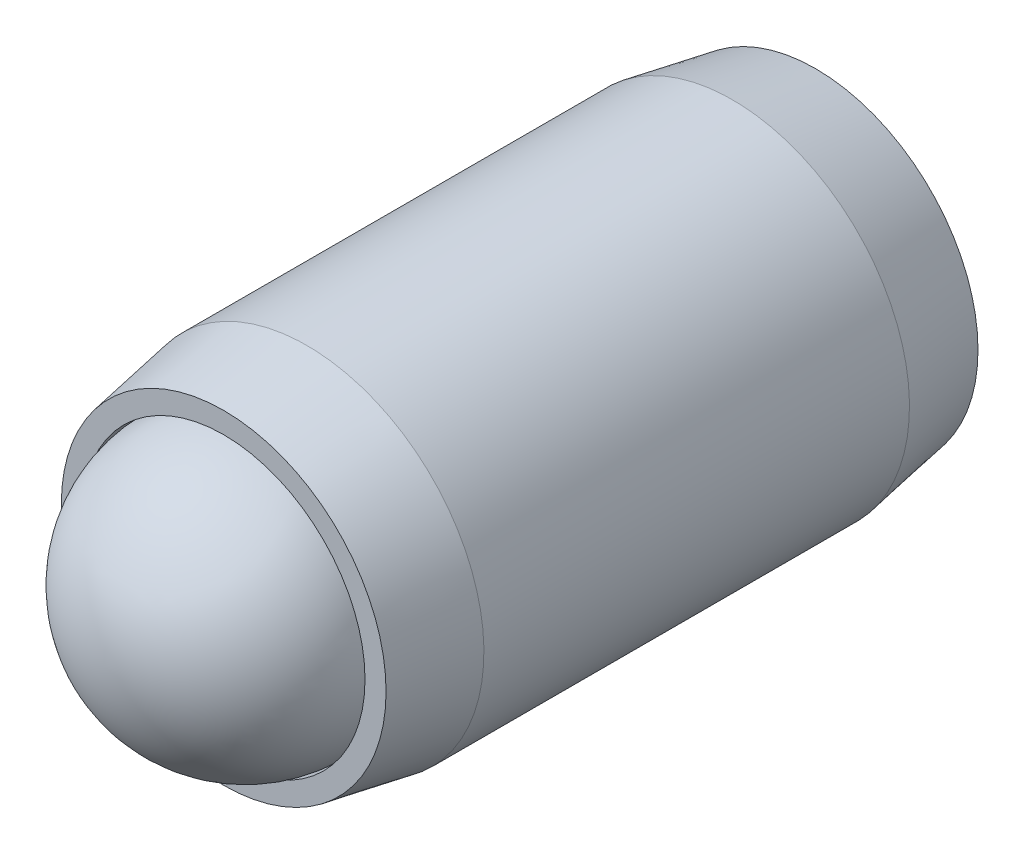
ISO-10303-21;
HEADER;
FILE_DESCRIPTION(('STEP AP214'),'2;1');
FILE_NAME('part.step','',(''),(''),'','','');
FILE_SCHEMA(('AUTOMOTIVE_DESIGN { 1 0 10303 214 1 1 1 1 }'));
ENDSEC;
DATA;
#1=APPLICATION_CONTEXT('core data for automotive mechanical design processes');
#2=APPLICATION_PROTOCOL_DEFINITION('international standard','automotive_design',2000,#1);
#3=PRODUCT_CONTEXT('',#1,'mechanical');
#4=PRODUCT('Part','Part','',(#3));
#5=PRODUCT_RELATED_PRODUCT_CATEGORY('part','',(#4));
#6=PRODUCT_DEFINITION_FORMATION('','',#4);
#7=PRODUCT_DEFINITION_CONTEXT('part definition',#1,'design');
#8=PRODUCT_DEFINITION('design','',#6,#7);
#9=PRODUCT_DEFINITION_SHAPE('','',#8);
#10=(LENGTH_UNIT() NAMED_UNIT(*) SI_UNIT(.MILLI.,.METRE.));
#11=(NAMED_UNIT(*) PLANE_ANGLE_UNIT() SI_UNIT($,.RADIAN.));
#12=(NAMED_UNIT(*) SI_UNIT($,.STERADIAN.) SOLID_ANGLE_UNIT());
#13=UNCERTAINTY_MEASURE_WITH_UNIT(LENGTH_MEASURE(1.E-05),#10,'distance_accuracy_value','');
#14=(GEOMETRIC_REPRESENTATION_CONTEXT(3) GLOBAL_UNCERTAINTY_ASSIGNED_CONTEXT((#13)) GLOBAL_UNIT_ASSIGNED_CONTEXT((#10,
#11,#12)) REPRESENTATION_CONTEXT('',''));
#15=CARTESIAN_POINT('',(0.,0.,0.));
#16=DIRECTION('',(0.,0.,1.));
#17=DIRECTION('',(1.,0.,0.));
#18=AXIS2_PLACEMENT_3D('',#15,#16,#17);
#19=CARTESIAN_POINT('',(0.,0.,4.63541968187893));
#20=DIRECTION('',(-0.605860662373687,-0.795570774845405,0.));
#21=DIRECTION('',(-0.795570774845405,0.605860662373687,0.));
#22=AXIS2_PLACEMENT_3D('',#19,#20,#21);
#23=SPHERICAL_SURFACE('',#22,2.38125);
#24=CARTESIAN_POINT('',(0.,0.,4.63541968187893));
#25=DIRECTION('',(0.,0.,-1.));
#26=DIRECTION('',(-0.795570774845405,0.605860662373687,0.));
#27=AXIS2_PLACEMENT_3D('',#24,#25,#26);
#28=SPHERICAL_SURFACE('',#27,2.38125);
#29=CARTESIAN_POINT('',(0.,0.,4.63541968187893));
#30=DIRECTION('',(0.,0.,-1.));
#31=DIRECTION('',(-0.795570774845405,0.605860662373687,0.));
#32=AXIS2_PLACEMENT_3D('',#29,#30,#31);
#33=CIRCLE('',#32,2.38125);
#34=CARTESIAN_POINT('',(-1.89445290760062,1.44270570227734,4.63541968187893));
#35=VERTEX_POINT('',#34);
#36=EDGE_CURVE('P0_E10',#35,#35,#33,.T.);
#37=ORIENTED_EDGE('',*,*,#36,.T.);
#38=EDGE_LOOP('',(#37));
#39=FACE_BOUND('',#38,.T.);
#40=ADVANCED_FACE('P0_F14',(#39),#28,.T.);
#41=CARTESIAN_POINT('',(0.,0.,4.63541968187893));
#42=DIRECTION('',(0.,0.,-1.));
#43=DIRECTION('',(-0.795570774845405,0.605860662373687,0.));
#44=AXIS2_PLACEMENT_3D('',#41,#42,#43);
#45=SPHERICAL_SURFACE('',#44,2.38125);
#46=ORIENTED_EDGE('',*,*,#36,.F.);
#47=EDGE_LOOP('',(#46));
#48=FACE_BOUND('',#47,.T.);
#49=ADVANCED_FACE('P0_F16',(#48),#45,.T.);
#50=CLOSED_SHELL('',(#40,#49));
#51=MANIFOLD_SOLID_BREP('P0_B1',#50);
#52=CARTESIAN_POINT('',(0.,0.,4.999999938));
#53=DIRECTION('',(0.,0.,-1.));
#54=DIRECTION('',(-1.,0.,0.));
#55=AXIS2_PLACEMENT_3D('',#52,#53,#54);
#56=CYLINDRICAL_SURFACE('',#55,2.991);
#57=CARTESIAN_POINT('',(0.,0.,3.59465630309867));
#58=DIRECTION('',(0.,0.,1.));
#59=DIRECTION('',(0.,-1.,0.));
#60=AXIS2_PLACEMENT_3D('',#57,#58,#59);
#61=CIRCLE('',#60,2.991);
#62=CARTESIAN_POINT('',(0.,-2.991,3.59465630309867));
#63=VERTEX_POINT('',#62);
#64=EDGE_CURVE('P1_E183',#63,#63,#61,.T.);
#65=ORIENTED_EDGE('',*,*,#64,.F.);
#66=EDGE_LOOP('',(#65));
#67=FACE_BOUND('',#66,.T.);
#68=CARTESIAN_POINT('',(0.,0.,-3.59465630309867));
#69=DIRECTION('',(0.,0.,1.));
#70=DIRECTION('',(0.,-1.,0.));
#71=AXIS2_PLACEMENT_3D('',#68,#69,#70);
#72=CIRCLE('',#71,2.991);
#73=CARTESIAN_POINT('',(0.,-2.991,-3.59465630309867));
#74=VERTEX_POINT('',#73);
#75=EDGE_CURVE('P1_E186',#74,#74,#72,.T.);
#76=ORIENTED_EDGE('',*,*,#75,.T.);
#77=EDGE_LOOP('',(#76));
#78=FACE_BOUND('',#77,.T.);
#79=ADVANCED_FACE('P1_F15',(#67,#78),#56,.T.);
#80=CARTESIAN_POINT('',(0.,0.,4.999999938));
#81=DIRECTION('',(0.,0.,-1.));
#82=DIRECTION('',(0.,1.,0.));
#83=AXIS2_PLACEMENT_3D('',#80,#81,#82);
#84=CONICAL_SURFACE('',#83,2.7432,0.174532925199426);
#85=ORIENTED_EDGE('',*,*,#64,.T.);
#86=EDGE_LOOP('',(#85));
#87=FACE_BOUND('',#86,.T.);
#88=CARTESIAN_POINT('',(0.,0.,4.999999938));
#89=DIRECTION('',(0.,0.,1.));
#90=DIRECTION('',(0.,-1.,0.));
#91=AXIS2_PLACEMENT_3D('',#88,#89,#90);
#92=CIRCLE('',#91,2.7432);
#93=CARTESIAN_POINT('',(0.,-2.7432,4.999999938));
#94=VERTEX_POINT('',#93);
#95=EDGE_CURVE('P1_E199',#94,#94,#92,.T.);
#96=ORIENTED_EDGE('',*,*,#95,.F.);
#97=EDGE_LOOP('',(#96));
#98=FACE_BOUND('',#97,.T.);
#99=ADVANCED_FACE('P1_F161',(#87,#98),#84,.T.);
#100=CARTESIAN_POINT('',(0.,0.,4.999999938));
#101=DIRECTION('',(0.,0.,1.));
#102=DIRECTION('',(1.,0.,0.));
#103=AXIS2_PLACEMENT_3D('',#100,#101,#102);
#104=PLANE('',#103);
#105=CARTESIAN_POINT('',(0.,0.,4.999999938));
#106=DIRECTION('',(0.,0.,1.));
#107=DIRECTION('',(1.,0.,0.));
#108=AXIS2_PLACEMENT_3D('',#105,#106,#107);
#109=CIRCLE('',#108,2.3876);
#110=CARTESIAN_POINT('',(2.3876,0.,4.999999938));
#111=VERTEX_POINT('',#110);
#112=EDGE_CURVE('P1_E194',#111,#111,#109,.T.);
#113=ORIENTED_EDGE('',*,*,#112,.F.);
#114=EDGE_LOOP('',(#113));
#115=FACE_BOUND('',#114,.T.);
#116=ORIENTED_EDGE('',*,*,#95,.T.);
#117=EDGE_LOOP('',(#116));
#118=FACE_BOUND('',#117,.T.);
#119=ADVANCED_FACE('P1_F158',(#115,#118),#104,.T.);
#120=CARTESIAN_POINT('',(0.,0.,-3.59465630309867));
#121=DIRECTION('',(0.,0.,1.));
#122=DIRECTION('',(0.,-1.,0.));
#123=AXIS2_PLACEMENT_3D('',#120,#121,#122);
#124=CONICAL_SURFACE('',#123,2.991,0.174532925199426);
#125=CARTESIAN_POINT('',(0.,0.,-4.999999938));
#126=DIRECTION('',(0.,0.,1.));
#127=DIRECTION('',(0.,-1.,0.));
#128=AXIS2_PLACEMENT_3D('',#125,#126,#127);
#129=CIRCLE('',#128,2.7432);
#130=CARTESIAN_POINT('',(0.,-2.7432,-4.999999938));
#131=VERTEX_POINT('',#130);
#132=EDGE_CURVE('P1_E188',#131,#131,#129,.T.);
#133=ORIENTED_EDGE('',*,*,#132,.T.);
#134=EDGE_LOOP('',(#133));
#135=FACE_BOUND('',#134,.T.);
#136=ORIENTED_EDGE('',*,*,#75,.F.);
#137=EDGE_LOOP('',(#136));
#138=FACE_BOUND('',#137,.T.);
#139=ADVANCED_FACE('P1_F160',(#135,#138),#124,.T.);
#140=CARTESIAN_POINT('',(0.,0.,-4.999999938));
#141=DIRECTION('',(0.,0.,1.));
#142=DIRECTION('',(1.,0.,0.));
#143=AXIS2_PLACEMENT_3D('',#140,#141,#142);
#144=PLANE('',#143);
#145=CARTESIAN_POINT('',(0.,0.,-4.999999938));
#146=DIRECTION('',(0.,0.,1.));
#147=DIRECTION('',(1.,0.,0.));
#148=AXIS2_PLACEMENT_3D('',#145,#146,#147);
#149=CIRCLE('',#148,1.14567944042316);
#150=CARTESIAN_POINT('',(0.572839720211583,-0.992187499999999,-4.999999938));
#151=VERTEX_POINT('',#150);
#152=CARTESIAN_POINT('',(1.14567944042316,0.,-4.999999938));
#153=VERTEX_POINT('',#152);
#154=EDGE_CURVE('P1_E18',#151,#153,#149,.T.);
#155=ORIENTED_EDGE('',*,*,#154,.T.);
#156=CARTESIAN_POINT('',(0.572839720211582,0.9921875,-4.999999938));
#157=VERTEX_POINT('',#156);
#158=EDGE_CURVE('P1_E10',#153,#157,#149,.T.);
#159=ORIENTED_EDGE('',*,*,#158,.T.);
#160=CARTESIAN_POINT('',(-0.572839720211582,0.9921875,-4.999999938));
#161=VERTEX_POINT('',#160);
#162=EDGE_CURVE('P1_E23',#157,#161,#149,.T.);
#163=ORIENTED_EDGE('',*,*,#162,.T.);
#164=CARTESIAN_POINT('',(0.,0.,-4.999999938));
#165=DIRECTION('',(0.,0.,-1.));
#166=DIRECTION('',(-1.,0.,0.));
#167=AXIS2_PLACEMENT_3D('',#164,#165,#166);
#168=CIRCLE('',#167,1.14567944042316);
#169=CARTESIAN_POINT('',(-1.14567944042316,0.,-4.999999938));
#170=VERTEX_POINT('',#169);
#171=EDGE_CURVE('P1_E76',#170,#161,#168,.T.);
#172=ORIENTED_EDGE('',*,*,#171,.F.);
#173=CARTESIAN_POINT('',(-0.572839720211581,-0.9921875,-4.999999938));
#174=VERTEX_POINT('',#173);
#175=EDGE_CURVE('P1_E84',#170,#174,#149,.T.);
#176=ORIENTED_EDGE('',*,*,#175,.T.);
#177=EDGE_CURVE('P1_E89',#174,#151,#149,.T.);
#178=ORIENTED_EDGE('',*,*,#177,.T.);
#179=EDGE_LOOP('',(#155,#159,#163,#172,#176,#178));
#180=FACE_BOUND('',#179,.T.);
#181=ORIENTED_EDGE('',*,*,#132,.F.);
#182=EDGE_LOOP('',(#181));
#183=FACE_BOUND('',#182,.T.);
#184=ADVANCED_FACE('P1_F90',(#180,#183),#144,.F.);
#185=CARTESIAN_POINT('',(0.,0.,3.655423636478));
#186=DIRECTION('',(0.,0.,1.));
#187=DIRECTION('',(1.,0.,0.));
#188=AXIS2_PLACEMENT_3D('',#185,#186,#187);
#189=CONICAL_SURFACE('',#188,2.3876,0.78539816339745);
#190=CARTESIAN_POINT('',(0.,0.,1.267823636478));
#191=VERTEX_POINT('',#190);
#192=VERTEX_LOOP('',#191);
#193=FACE_BOUND('',#192,.T.);
#194=CARTESIAN_POINT('',(0.,0.,3.655423636478));
#195=DIRECTION('',(0.,0.,1.));
#196=DIRECTION('',(1.,0.,0.));
#197=AXIS2_PLACEMENT_3D('',#194,#195,#196);
#198=CIRCLE('',#197,2.3876);
#199=CARTESIAN_POINT('',(2.3876,0.,3.655423636478));
#200=VERTEX_POINT('',#199);
#201=EDGE_CURVE('P1_E189',#200,#200,#198,.T.);
#202=ORIENTED_EDGE('',*,*,#201,.T.);
#203=EDGE_LOOP('',(#202));
#204=FACE_BOUND('',#203,.T.);
#205=ADVANCED_FACE('P1_F164',(#193,#204),#189,.F.);
#206=CARTESIAN_POINT('',(0.,0.,4.999999938));
#207=DIRECTION('',(0.,0.,1.));
#208=DIRECTION('',(1.,0.,0.));
#209=AXIS2_PLACEMENT_3D('',#206,#207,#208);
#210=CYLINDRICAL_SURFACE('',#209,2.3876);
#211=ORIENTED_EDGE('',*,*,#201,.F.);
#212=EDGE_LOOP('',(#211));
#213=FACE_BOUND('',#212,.T.);
#214=ORIENTED_EDGE('',*,*,#112,.T.);
#215=EDGE_LOOP('',(#214));
#216=FACE_BOUND('',#215,.T.);
#217=ADVANCED_FACE('P1_F131',(#213,#216),#210,.F.);
#218=CARTESIAN_POINT('',(0.,0.,-4.999999938));
#219=DIRECTION('',(0.,0.,-1.));
#220=DIRECTION('',(-1.,0.,0.));
#221=AXIS2_PLACEMENT_3D('',#218,#219,#220);
#222=CONICAL_SURFACE('',#221,1.14567944042316,0.78539816339745);
#223=ORIENTED_EDGE('',*,*,#154,.F.);
#224=CARTESIAN_POINT('',(1.145794910477,0.000199999999999862,-5.00011542550897));
#225=CARTESIAN_POINT('',(1.12609913995856,-0.0339140752321561,-4.98043274940465));
#226=CARTESIAN_POINT('',(1.10607402631377,-0.0685985894922797,-4.96190562251841));
#227=CARTESIAN_POINT('',(1.06524035596264,-0.139324581199959,-4.92798226765041));
#228=CARTESIAN_POINT('',(1.04442791197037,-0.175372791624242,-4.91260492523095));
#229=CARTESIAN_POINT('',(1.00246048249572,-0.248062511737395,-4.88626308073428));
#230=CARTESIAN_POINT('',(0.981316196707012,-0.284685489013201,-4.87523233451314));
#231=CARTESIAN_POINT('',(0.938562244623588,-0.358737506246056,-4.85823614367294));
#232=CARTESIAN_POINT('',(0.916953885244212,-0.396164282559342,-4.85225800557892));
#233=CARTESIAN_POINT('',(0.879714587318154,-0.46066463860547,-4.84686628291429));
#234=CARTESIAN_POINT('',(0.864132099442442,-0.487654299314529,-4.84606893438834));
#235=CARTESIAN_POINT('',(0.832997298779852,-0.541581355945663,-4.84740813136142));
#236=CARTESIAN_POINT('',(0.817444993408173,-0.568518739024239,-4.84954532413705));
#237=CARTESIAN_POINT('',(0.771010163908485,-0.648946222958496,-4.86021750930602));
#238=CARTESIAN_POINT('',(0.740358726795446,-0.702036069363282,-4.87301431872271));
#239=CARTESIAN_POINT('',(0.68656205513008,-0.795214637965796,-4.90389740565013));
#240=CARTESIAN_POINT('',(0.663164549602744,-0.835740306309515,-4.9203649469077));
#241=CARTESIAN_POINT('',(0.617285982385523,-0.915204315708207,-4.95746032155681));
#242=CARTESIAN_POINT('',(0.594802217831308,-0.954147338261523,-4.97807461864554));
#243=CARTESIAN_POINT('',(0.572724250157744,-0.992387499999999,-5.00011542550897));
#244=B_SPLINE_CURVE_WITH_KNOTS('',3,(#224,#225,#226,#227,#228,#229,#230,#231,#232,#233,#234,
#235,#236,#237,#238,#239,#240,#241,#242,#243),.UNSPECIFIED.,.F.,.F.,(4,2,2,2,2,2,2,2,2,4),(0.,
0.13219718521019,0.265165186853262,0.396020097605669,0.526545281028573,0.619935205043264,
0.713345731536163,0.900220051846368,1.04884529769095,1.1969930355767),.UNSPECIFIED.);
#245=EDGE_CURVE('P1_E108',#153,#151,#244,.T.);
#246=ORIENTED_EDGE('',*,*,#245,.F.);
#247=EDGE_LOOP('',(#223,#246));
#248=FACE_BOUND('',#247,.T.);
#249=ADVANCED_FACE('P1_F126',(#248),#222,.F.);
#250=ORIENTED_EDGE('',*,*,#177,.F.);
#251=CARTESIAN_POINT('',(-1.14247621095534,-0.9921875,-5.36749197753379));
#252=CARTESIAN_POINT('',(-1.11465764817297,-0.9921875,-5.34649157737037));
#253=CARTESIAN_POINT('',(-1.08668408109739,-0.9921875,-5.32569708582163));
#254=CARTESIAN_POINT('',(-1.03036405380652,-0.9921875,-5.28460497579312));
#255=CARTESIAN_POINT('',(-1.00201750238008,-0.9921875,-5.26430748245849));
#256=CARTESIAN_POINT('',(-0.915909012474785,-0.9921875,-5.20399844558086));
#257=CARTESIAN_POINT('',(-0.857501195957519,-0.9921875,-5.16489379024995));
#258=CARTESIAN_POINT('',(-0.735022281337406,-0.9921875,-5.08812669081868));
#259=CARTESIAN_POINT('',(-0.670818221979872,-0.9921875,-5.0506739690437));
#260=CARTESIAN_POINT('',(-0.539203244273795,-0.9921875,-4.98216495848978));
#261=CARTESIAN_POINT('',(-0.471804119013398,-0.9921875,-4.95108710627442));
#262=CARTESIAN_POINT('',(-0.370637445291611,-0.9921875,-4.91306623424996));
#263=CARTESIAN_POINT('',(-0.338367677294405,-0.9921875,-4.9021539703464));
#264=CARTESIAN_POINT('',(-0.273049086298104,-0.9921875,-4.88292016811298));
#265=CARTESIAN_POINT('',(-0.240000209797912,-0.9921875,-4.87459880826028));
#266=CARTESIAN_POINT('',(-0.173878395879219,-0.9921875,-4.86111871169319));
#267=CARTESIAN_POINT('',(-0.140816774783574,-0.9921875,-4.85590533197466));
#268=CARTESIAN_POINT('',(-0.0743291672741459,-0.9921875,-4.84873965046279));
#269=CARTESIAN_POINT('',(-0.0409031260707376,-0.9921875,-4.8467878460388));
#270=CARTESIAN_POINT('',(0.0247631140270456,-0.9921875,-4.84629342390368));
#271=CARTESIAN_POINT('',(0.057002444411226,-0.9921875,-4.84762996941573));
#272=CARTESIAN_POINT('',(0.121194220405734,-0.9921875,-4.85337098120236));
#273=CARTESIAN_POINT('',(0.153146730267991,-0.9921875,-4.85777474207893));
#274=CARTESIAN_POINT('',(0.217090524553671,-0.9921875,-4.86948444913751));
#275=CARTESIAN_POINT('',(0.249072542042749,-0.9921875,-4.87684024041065));
#276=CARTESIAN_POINT('',(0.312337779646055,-0.9921875,-4.89406302935171));
#277=CARTESIAN_POINT('',(0.34362105799319,-0.9921875,-4.90392981689742));
#278=CARTESIAN_POINT('',(0.442112982998624,-0.9921875,-4.93870604954092));
#279=CARTESIAN_POINT('',(0.507919771037747,-0.9921875,-4.96757610207796));
#280=CARTESIAN_POINT('',(0.636441890981752,-0.9921875,-5.03176514781482));
#281=CARTESIAN_POINT('',(0.699145053739845,-0.9921875,-5.06710731008238));
#282=CARTESIAN_POINT('',(0.818979829838884,-0.9921875,-5.14002130870446));
#283=CARTESIAN_POINT('',(0.876233471440129,-0.9921875,-5.17739507286827));
#284=CARTESIAN_POINT('',(0.960585190489402,-0.9921875,-5.23517104969895));
#285=CARTESIAN_POINT('',(0.988338378120951,-0.9921875,-5.25463342545696));
#286=CARTESIAN_POINT('',(1.0434655130954,-0.9921875,-5.29407291954095));
#287=CARTESIAN_POINT('',(1.070839562073,-0.9921875,-5.31404989564561));
#288=CARTESIAN_POINT('',(1.09805574489947,-0.9921875,-5.33424024339516));
#289=B_SPLINE_CURVE_WITH_KNOTS('',3,(#251,#252,#253,#254,#255,#256,#257,#258,#259,#260,#261,
#262,#263,#264,#265,#266,#267,#268,#269,#270,#271,#272,#273,#274,#275,#276,#277,#278,#279,#280,
#281,#282,#283,#284,#285,#286,#287,#288),.UNSPECIFIED.,.F.,.F.,(4,2,2,2,2,2,2,2,2,2,2,2,2,2,2,2,
2,2,4),(0.,0.104563127391605,0.209152318718919,0.419927099055486,0.642732653996013,
0.864771652302187,0.966879847198757,1.06899507437088,1.1692575299655,1.2695352735478,
1.36618351698525,1.4628095406014,1.56114078104352,1.65946379575192,1.87441437169281,
2.090150036015,2.29516517561956,2.39685303361285,2.4985130831926),.UNSPECIFIED.);
#290=EDGE_CURVE('P1_E106',#151,#174,#289,.F.);
#291=ORIENTED_EDGE('',*,*,#290,.F.);
#292=EDGE_LOOP('',(#250,#291));
#293=FACE_BOUND('',#292,.T.);
#294=ADVANCED_FACE('P1_F130',(#293),#222,.F.);
#295=ORIENTED_EDGE('',*,*,#175,.F.);
#296=CARTESIAN_POINT('',(-0.572724250157744,-0.9923875,-5.00011542550897));
#297=CARTESIAN_POINT('',(-0.592420020676184,-0.958273424767844,-4.98043274940465));
#298=CARTESIAN_POINT('',(-0.612445134320978,-0.92358891050772,-4.96190562251841));
#299=CARTESIAN_POINT('',(-0.65327880467211,-0.85286291880004,-4.92798226765041));
#300=CARTESIAN_POINT('',(-0.674091248664375,-0.816814708375757,-4.91260492523095));
#301=CARTESIAN_POINT('',(-0.716058678139022,-0.744124988262603,-4.88626308073428));
#302=CARTESIAN_POINT('',(-0.737202963927734,-0.707502010986798,-4.87523233451314));
#303=CARTESIAN_POINT('',(-0.779956916011158,-0.633449993753942,-4.85823614367294));
#304=CARTESIAN_POINT('',(-0.801565275390534,-0.596023217440656,-4.85225800557892));
#305=CARTESIAN_POINT('',(-0.838804573316593,-0.531522861394528,-4.84686628291429));
#306=CARTESIAN_POINT('',(-0.854387061192304,-0.504533200685469,-4.84606893438834));
#307=CARTESIAN_POINT('',(-0.885521861854894,-0.450606144054334,-4.84740813136142));
#308=CARTESIAN_POINT('',(-0.901074167226574,-0.423668760975759,-4.84954532413705));
#309=CARTESIAN_POINT('',(-0.947508996726262,-0.343241277041501,-4.86021750930602));
#310=CARTESIAN_POINT('',(-0.978160433839301,-0.290151430636716,-4.87301431872271));
#311=CARTESIAN_POINT('',(-1.03195710550467,-0.196972862034201,-4.90389740565013));
#312=CARTESIAN_POINT('',(-1.055354611032,-0.156447193690482,-4.92036494690771));
#313=CARTESIAN_POINT('',(-1.10123317824922,-0.0769831842917921,-4.95746032155681));
#314=CARTESIAN_POINT('',(-1.12371694280344,-0.0380401617384761,-4.97807461864554));
#315=CARTESIAN_POINT('',(-1.145794910477,0.000200000000000063,-5.00011542550897));
#316=B_SPLINE_CURVE_WITH_KNOTS('',3,(#296,#297,#298,#299,#300,#301,#302,#303,#304,#305,#306,
#307,#308,#309,#310,#311,#312,#313,#314,#315),.UNSPECIFIED.,.F.,.F.,(4,2,2,2,2,2,2,2,2,4),(0.,
0.13219718521019,0.265165186853263,0.39602009760567,0.526545281028575,0.619935205043266,
0.713345731536165,0.90022005184637,1.04884529769095,1.19699303557669),.UNSPECIFIED.);
#317=EDGE_CURVE('P1_E79',#174,#170,#316,.T.);
#318=ORIENTED_EDGE('',*,*,#317,.F.);
#319=EDGE_LOOP('',(#295,#318));
#320=FACE_BOUND('',#319,.T.);
#321=ADVANCED_FACE('P1_F85',(#320),#222,.F.);
#322=ORIENTED_EDGE('',*,*,#171,.T.);
#323=CARTESIAN_POINT('',(-1.145794910477,-0.000199999999999718,-5.00011542550897));
#324=CARTESIAN_POINT('',(-1.12609913995856,0.0339140752321563,-4.98043274940465));
#325=CARTESIAN_POINT('',(-1.10607402631377,0.06859858949228,-4.96190562251841));
#326=CARTESIAN_POINT('',(-1.06524035596264,0.13932458119996,-4.92798226765041));
#327=CARTESIAN_POINT('',(-1.04442791197037,0.175372791624243,-4.91260492523095));
#328=CARTESIAN_POINT('',(-1.00246048249572,0.248062511737396,-4.88626308073428));
#329=CARTESIAN_POINT('',(-0.981316196707011,0.284685489013202,-4.87523233451314));
#330=CARTESIAN_POINT('',(-0.938562244623587,0.358737506246057,-4.85823614367294));
#331=CARTESIAN_POINT('',(-0.916953885244212,0.396164282559343,-4.85225800557892));
#332=CARTESIAN_POINT('',(-0.879714587318153,0.460664638605472,-4.84686628291429));
#333=CARTESIAN_POINT('',(-0.864132099442441,0.48765429931453,-4.84606893438834));
#334=CARTESIAN_POINT('',(-0.832997298779852,0.541581355945665,-4.84740813136142));
#335=CARTESIAN_POINT('',(-0.817444993408172,0.56851873902424,-4.84954532413705));
#336=CARTESIAN_POINT('',(-0.771010163908484,0.648946222958498,-4.86021750930602));
#337=CARTESIAN_POINT('',(-0.740358726795445,0.702036069363284,-4.87301431872271));
#338=CARTESIAN_POINT('',(-0.686562055130079,0.795214637965798,-4.90389740565013));
#339=CARTESIAN_POINT('',(-0.663164549602744,0.835740306309517,-4.92036494690771));
#340=CARTESIAN_POINT('',(-0.617285982385523,0.915204315708207,-4.95746032155681));
#341=CARTESIAN_POINT('',(-0.594802217831308,0.954147338261523,-4.97807461864554));
#342=CARTESIAN_POINT('',(-0.572724250157744,0.992387499999999,-5.00011542550897));
#343=B_SPLINE_CURVE_WITH_KNOTS('',3,(#323,#324,#325,#326,#327,#328,#329,#330,#331,#332,#333,
#334,#335,#336,#337,#338,#339,#340,#341,#342),.UNSPECIFIED.,.F.,.F.,(4,2,2,2,2,2,2,2,2,4),(0.,
0.13219718521019,0.265165186853263,0.39602009760567,0.526545281028574,0.619935205043265,
0.713345731536165,0.90022005184637,1.04884529769095,1.19699303557669),.UNSPECIFIED.);
#344=EDGE_CURVE('P1_E72',#170,#161,#343,.T.);
#345=ORIENTED_EDGE('',*,*,#344,.F.);
#346=EDGE_LOOP('',(#322,#345));
#347=FACE_BOUND('',#346,.T.);
#348=ADVANCED_FACE('P1_F74',(#347),#222,.F.);
#349=ORIENTED_EDGE('',*,*,#162,.F.);
#350=CARTESIAN_POINT('',(-1.14247621078911,0.9921875,-5.36749197740828));
#351=CARTESIAN_POINT('',(-1.11465764801141,0.9921875,-5.3464915772497));
#352=CARTESIAN_POINT('',(-1.08668408094051,0.9921875,-5.32569708570578));
#353=CARTESIAN_POINT('',(-1.03036405365904,0.9921875,-5.2846049756869));
#354=CARTESIAN_POINT('',(-1.00201750223733,0.9921875,-5.26430748235707));
#355=CARTESIAN_POINT('',(-0.915909012346496,0.9921875,-5.20399844549393));
#356=CARTESIAN_POINT('',(-0.857501195839066,0.9921875,-5.16489379017264));
#357=CARTESIAN_POINT('',(-0.735022281240404,0.9921875,-5.08812669076114));
#358=CARTESIAN_POINT('',(-0.670818221894542,0.9921875,-5.05067396899626));
#359=CARTESIAN_POINT('',(-0.539203244212802,0.9921875,-4.98216495846105));
#360=CARTESIAN_POINT('',(-0.471804118965061,0.9921875,-4.95108710625431));
#361=CARTESIAN_POINT('',(-0.370637445252798,0.9921875,-4.91306623423626));
#362=CARTESIAN_POINT('',(-0.338367677251603,0.9921875,-4.90215397033245));
#363=CARTESIAN_POINT('',(-0.273049086247197,0.9921875,-4.88292016809933));
#364=CARTESIAN_POINT('',(-0.240000209742886,0.9921875,-4.87459880824719));
#365=CARTESIAN_POINT('',(-0.173878395816094,0.9921875,-4.86111871168215));
#366=CARTESIAN_POINT('',(-0.14081677471647,0.9921875,-4.85590533196509));
#367=CARTESIAN_POINT('',(-0.0743291671992138,0.9921875,-4.84873965045706));
#368=CARTESIAN_POINT('',(-0.0409031259919569,0.9921875,-4.84678784603542));
#369=CARTESIAN_POINT('',(0.0247631141129259,0.9921875,-4.84629342390571));
#370=CARTESIAN_POINT('',(0.0570024445003674,0.9921875,-4.84762996942075));
#371=CARTESIAN_POINT('',(0.121194220501071,0.9921875,-4.85337098121384));
#372=CARTESIAN_POINT('',(0.153146730366263,0.9921875,-4.85777474209387));
#373=CARTESIAN_POINT('',(0.217090524657736,0.9921875,-4.86948444915969));
#374=CARTESIAN_POINT('',(0.249072542149665,0.9921875,-4.87684024043665));
#375=CARTESIAN_POINT('',(0.312337779758396,0.9921875,-4.8940630293854));
#376=CARTESIAN_POINT('',(0.343621058108106,0.9921875,-4.90392981693501));
#377=CARTESIAN_POINT('',(0.442112983138563,0.9921875,-4.93870604959688));
#378=CARTESIAN_POINT('',(0.50791977119888,0.9921875,-4.96757610215081));
#379=CARTESIAN_POINT('',(0.636441891183645,0.9921875,-5.03176514792333));
#380=CARTESIAN_POINT('',(0.699145053961295,0.9921875,-5.06710731020965));
#381=CARTESIAN_POINT('',(0.818979830095495,0.9921875,-5.14002130886766));
#382=CARTESIAN_POINT('',(0.876233471712469,0.9921875,-5.17739507304847));
#383=CARTESIAN_POINT('',(0.960585190784999,0.9921875,-5.23517104990454));
#384=CARTESIAN_POINT('',(0.988338378424189,0.9921875,-5.25463342567096));
#385=CARTESIAN_POINT('',(1.04346551341387,0.9921875,-5.29407291977173));
#386=CARTESIAN_POINT('',(1.07083956239906,0.9921875,-5.31404989588478));
#387=CARTESIAN_POINT('',(1.09805574523311,0.9921875,-5.33424024364271));
#388=B_SPLINE_CURVE_WITH_KNOTS('',3,(#350,#351,#352,#353,#354,#355,#356,#357,#358,#359,#360,
#361,#362,#363,#364,#365,#366,#367,#368,#369,#370,#371,#372,#373,#374,#375,#376,#377,#378,#379,
#380,#381,#382,#383,#384,#385,#386,#387),.UNSPECIFIED.,.F.,.F.,(4,2,2,2,2,2,2,2,2,2,2,2,2,2,2,2,
2,2,4),(0.,0.104563127371703,0.209152318679108,0.419927098975114,0.642732653870155,
0.864771652131277,0.966879847039378,1.06899507422301,1.16925752982867,1.26953527342202,
1.36618351686957,1.46280954049584,1.56114078094885,1.65946379566813,1.87441437168727,
2.09015003608822,2.29516517576016,2.39685303378669,2.49851308339968),.UNSPECIFIED.);
#389=EDGE_CURVE('P1_E80',#161,#157,#388,.T.);
#390=ORIENTED_EDGE('',*,*,#389,.F.);
#391=EDGE_LOOP('',(#349,#390));
#392=FACE_BOUND('',#391,.T.);
#393=ADVANCED_FACE('P1_F230',(#392),#222,.F.);
#394=ORIENTED_EDGE('',*,*,#158,.F.);
#395=CARTESIAN_POINT('',(0.572724250157744,0.9923875,-5.00011542550897));
#396=CARTESIAN_POINT('',(0.592420020676185,0.958273424767844,-4.98043274940465));
#397=CARTESIAN_POINT('',(0.612445134320979,0.92358891050772,-4.96190562251841));
#398=CARTESIAN_POINT('',(0.653278804672111,0.85286291880004,-4.92798226765041));
#399=CARTESIAN_POINT('',(0.674091248664375,0.816814708375757,-4.91260492523095));
#400=CARTESIAN_POINT('',(0.716058678139023,0.744124988262603,-4.88626308073428));
#401=CARTESIAN_POINT('',(0.737202963927735,0.707502010986798,-4.87523233451314));
#402=CARTESIAN_POINT('',(0.779956916011158,0.633449993753942,-4.85823614367294));
#403=CARTESIAN_POINT('',(0.801565275390534,0.596023217440656,-4.85225800557892));
#404=CARTESIAN_POINT('',(0.838804573316593,0.531522861394528,-4.84686628291429));
#405=CARTESIAN_POINT('',(0.854387061192305,0.504533200685469,-4.84606893438834));
#406=CARTESIAN_POINT('',(0.885521861854894,0.450606144054334,-4.84740813136142));
#407=CARTESIAN_POINT('',(0.901074167226574,0.423668760975759,-4.84954532413705));
#408=CARTESIAN_POINT('',(0.947508996726262,0.343241277041501,-4.86021750930602));
#409=CARTESIAN_POINT('',(0.978160433839301,0.290151430636716,-4.87301431872271));
#410=CARTESIAN_POINT('',(1.03195710550467,0.196972862034201,-4.90389740565013));
#411=CARTESIAN_POINT('',(1.055354611032,0.156447193690483,-4.92036494690771));
#412=CARTESIAN_POINT('',(1.10123317824922,0.0769831842917925,-4.95746032155681));
#413=CARTESIAN_POINT('',(1.12371694280344,0.0380401617384766,-4.97807461864554));
#414=CARTESIAN_POINT('',(1.145794910477,-0.00019999999999964,-5.00011542550897));
#415=B_SPLINE_CURVE_WITH_KNOTS('',3,(#395,#396,#397,#398,#399,#400,#401,#402,#403,#404,#405,
#406,#407,#408,#409,#410,#411,#412,#413,#414),.UNSPECIFIED.,.F.,.F.,(4,2,2,2,2,2,2,2,2,4),(0.,
0.13219718521019,0.265165186853263,0.39602009760567,0.526545281028575,0.619935205043266,
0.713345731536166,0.90022005184637,1.04884529769095,1.19699303557669),.UNSPECIFIED.);
#416=EDGE_CURVE('P1_E93',#157,#153,#415,.T.);
#417=ORIENTED_EDGE('',*,*,#416,.F.);
#418=EDGE_LOOP('',(#394,#417));
#419=FACE_BOUND('',#418,.T.);
#420=ADVANCED_FACE('P1_F133',(#419),#222,.F.);
#421=CARTESIAN_POINT('',(0.,0.,-1.951999938));
#422=DIRECTION('',(0.,0.,-1.));
#423=DIRECTION('',(-1.,0.,0.));
#424=AXIS2_PLACEMENT_3D('',#421,#422,#423);
#425=PLANE('',#424);
#426=DIRECTION('',(1.,0.,0.));
#427=VECTOR('',#426,1.);
#428=CARTESIAN_POINT('',(-0.572839720211582,0.9921875,-1.951999938));
#429=LINE('',#428,#427);
#430=CARTESIAN_POINT('',(-0.572839720211582,0.9921875,-1.951999938));
#431=VERTEX_POINT('',#430);
#432=CARTESIAN_POINT('',(0.572839720211582,0.9921875,-1.951999938));
#433=VERTEX_POINT('',#432);
#434=EDGE_CURVE('P1_E202',#431,#433,#429,.T.);
#435=ORIENTED_EDGE('',*,*,#434,.T.);
#436=DIRECTION('',(0.5,-0.866025403784439,0.));
#437=VECTOR('',#436,1.);
#438=CARTESIAN_POINT('',(0.572839720211582,0.9921875,-1.951999938));
#439=LINE('',#438,#437);
#440=CARTESIAN_POINT('',(1.14567944042316,0.,-1.951999938));
#441=VERTEX_POINT('',#440);
#442=EDGE_CURVE('P1_E205',#433,#441,#439,.T.);
#443=ORIENTED_EDGE('',*,*,#442,.T.);
#444=DIRECTION('',(-0.5,-0.866025403784438,0.));
#445=VECTOR('',#444,1.);
#446=CARTESIAN_POINT('',(1.14567944042316,0.,-1.951999938));
#447=LINE('',#446,#445);
#448=CARTESIAN_POINT('',(0.572839720211582,-0.9921875,-1.951999938));
#449=VERTEX_POINT('',#448);
#450=EDGE_CURVE('P1_E208',#441,#449,#447,.T.);
#451=ORIENTED_EDGE('',*,*,#450,.T.);
#452=DIRECTION('',(-1.,0.,0.));
#453=VECTOR('',#452,1.);
#454=CARTESIAN_POINT('',(0.572839720211582,-0.9921875,-1.951999938));
#455=LINE('',#454,#453);
#456=CARTESIAN_POINT('',(-0.572839720211582,-0.9921875,-1.951999938));
#457=VERTEX_POINT('',#456);
#458=EDGE_CURVE('P1_E211',#449,#457,#455,.T.);
#459=ORIENTED_EDGE('',*,*,#458,.T.);
#460=DIRECTION('',(-0.5,0.866025403784439,0.));
#461=VECTOR('',#460,1.);
#462=CARTESIAN_POINT('',(-0.572839720211582,-0.9921875,-1.951999938));
#463=LINE('',#462,#461);
#464=CARTESIAN_POINT('',(-1.14567944042316,0.,-1.951999938));
#465=VERTEX_POINT('',#464);
#466=EDGE_CURVE('P1_E214',#457,#465,#463,.T.);
#467=ORIENTED_EDGE('',*,*,#466,.T.);
#468=DIRECTION('',(0.5,0.866025403784439,0.));
#469=VECTOR('',#468,1.);
#470=CARTESIAN_POINT('',(-1.14567944042316,0.,-1.951999938));
#471=LINE('',#470,#469);
#472=EDGE_CURVE('P1_E98',#465,#431,#471,.T.);
#473=ORIENTED_EDGE('',*,*,#472,.T.);
#474=EDGE_LOOP('',(#435,#443,#451,#459,#467,#473));
#475=FACE_BOUND('',#474,.T.);
#476=ADVANCED_FACE('P1_F239',(#475),#425,.T.);
#477=CARTESIAN_POINT('',(0.572839720211582,0.9921875,-1.951999938));
#478=DIRECTION('',(0.866025403784439,0.5,0.));
#479=DIRECTION('',(-0.5,0.866025403784439,0.));
#480=AXIS2_PLACEMENT_3D('',#477,#478,#479);
#481=PLANE('',#480);
#482=DIRECTION('',(0.,0.,-1.));
#483=VECTOR('',#482,1.);
#484=CARTESIAN_POINT('',(0.572839720211582,0.9921875,-1.951999938));
#485=LINE('',#484,#483);
#486=EDGE_CURVE('P1_E217',#433,#157,#485,.T.);
#487=ORIENTED_EDGE('',*,*,#486,.T.);
#488=ORIENTED_EDGE('',*,*,#416,.T.);
#489=DIRECTION('',(0.,0.,-1.));
#490=VECTOR('',#489,1.);
#491=CARTESIAN_POINT('',(1.14567944042316,0.,-1.951999938));
#492=LINE('',#491,#490);
#493=EDGE_CURVE('P1_E223',#441,#153,#492,.T.);
#494=ORIENTED_EDGE('',*,*,#493,.F.);
#495=ORIENTED_EDGE('',*,*,#442,.F.);
#496=EDGE_LOOP('',(#487,#488,#494,#495));
#497=FACE_BOUND('',#496,.T.);
#498=ADVANCED_FACE('P1_F154',(#497),#481,.F.);
#499=CARTESIAN_POINT('',(-0.572839720211582,0.9921875,-1.951999938));
#500=DIRECTION('',(0.,1.,0.));
#501=DIRECTION('',(0.,0.,1.));
#502=AXIS2_PLACEMENT_3D('',#499,#500,#501);
#503=PLANE('',#502);
#504=DIRECTION('',(0.,0.,-1.));
#505=VECTOR('',#504,1.);
#506=CARTESIAN_POINT('',(-0.572839720211582,0.9921875,-1.951999938));
#507=LINE('',#506,#505);
#508=EDGE_CURVE('P1_E36',#431,#161,#507,.T.);
#509=ORIENTED_EDGE('',*,*,#508,.T.);
#510=ORIENTED_EDGE('',*,*,#389,.T.);
#511=ORIENTED_EDGE('',*,*,#486,.F.);
#512=ORIENTED_EDGE('',*,*,#434,.F.);
#513=EDGE_LOOP('',(#509,#510,#511,#512));
#514=FACE_BOUND('',#513,.T.);
#515=ADVANCED_FACE('P1_F150',(#514),#503,.F.);
#516=CARTESIAN_POINT('',(-1.14567944042316,0.,-1.951999938));
#517=DIRECTION('',(-0.866025403784439,0.5,0.));
#518=DIRECTION('',(-0.5,-0.866025403784439,0.));
#519=AXIS2_PLACEMENT_3D('',#516,#517,#518);
#520=PLANE('',#519);
#521=DIRECTION('',(0.,0.,-1.));
#522=VECTOR('',#521,1.);
#523=CARTESIAN_POINT('',(-1.14567944042316,0.,-1.951999938));
#524=LINE('',#523,#522);
#525=EDGE_CURVE('P1_E95',#465,#170,#524,.T.);
#526=ORIENTED_EDGE('',*,*,#525,.T.);
#527=ORIENTED_EDGE('',*,*,#344,.T.);
#528=ORIENTED_EDGE('',*,*,#508,.F.);
#529=ORIENTED_EDGE('',*,*,#472,.F.);
#530=EDGE_LOOP('',(#526,#527,#528,#529));
#531=FACE_BOUND('',#530,.T.);
#532=ADVANCED_FACE('P1_F96',(#531),#520,.F.);
#533=CARTESIAN_POINT('',(-0.572839720211582,-0.9921875,-1.951999938));
#534=DIRECTION('',(-0.866025403784439,-0.5,0.));
#535=DIRECTION('',(0.5,-0.866025403784439,0.));
#536=AXIS2_PLACEMENT_3D('',#533,#534,#535);
#537=PLANE('',#536);
#538=DIRECTION('',(0.,0.,-1.));
#539=VECTOR('',#538,1.);
#540=CARTESIAN_POINT('',(-0.572839720211582,-0.9921875,-1.951999938));
#541=LINE('',#540,#539);
#542=EDGE_CURVE('P1_E102',#457,#174,#541,.T.);
#543=ORIENTED_EDGE('',*,*,#542,.T.);
#544=ORIENTED_EDGE('',*,*,#317,.T.);
#545=ORIENTED_EDGE('',*,*,#525,.F.);
#546=ORIENTED_EDGE('',*,*,#466,.F.);
#547=EDGE_LOOP('',(#543,#544,#545,#546));
#548=FACE_BOUND('',#547,.T.);
#549=ADVANCED_FACE('P1_F104',(#548),#537,.F.);
#550=CARTESIAN_POINT('',(0.572839720211582,-0.9921875,-1.951999938));
#551=DIRECTION('',(0.,-1.,0.));
#552=DIRECTION('',(1.,0.,0.));
#553=AXIS2_PLACEMENT_3D('',#550,#551,#552);
#554=PLANE('',#553);
#555=DIRECTION('',(0.,0.,-1.));
#556=VECTOR('',#555,1.);
#557=CARTESIAN_POINT('',(0.572839720211582,-0.9921875,-1.951999938));
#558=LINE('',#557,#556);
#559=EDGE_CURVE('P1_E220',#449,#151,#558,.T.);
#560=ORIENTED_EDGE('',*,*,#559,.T.);
#561=ORIENTED_EDGE('',*,*,#290,.T.);
#562=ORIENTED_EDGE('',*,*,#542,.F.);
#563=ORIENTED_EDGE('',*,*,#458,.F.);
#564=EDGE_LOOP('',(#560,#561,#562,#563));
#565=FACE_BOUND('',#564,.T.);
#566=ADVANCED_FACE('P1_F241',(#565),#554,.F.);
#567=CARTESIAN_POINT('',(1.14567944042316,0.,-1.951999938));
#568=DIRECTION('',(0.866025403784438,-0.5,0.));
#569=DIRECTION('',(0.5,0.866025403784439,0.));
#570=AXIS2_PLACEMENT_3D('',#567,#568,#569);
#571=PLANE('',#570);
#572=ORIENTED_EDGE('',*,*,#493,.T.);
#573=ORIENTED_EDGE('',*,*,#245,.T.);
#574=ORIENTED_EDGE('',*,*,#559,.F.);
#575=ORIENTED_EDGE('',*,*,#450,.F.);
#576=EDGE_LOOP('',(#572,#573,#574,#575));
#577=FACE_BOUND('',#576,.T.);
#578=ADVANCED_FACE('P1_F236',(#577),#571,.F.);
#579=CLOSED_SHELL('',(#79,#99,#119,#139,#184,#205,#217,#249,#294,#321,#348,#393,#420,#476,#498,
#515,#532,#549,#566,#578));
#580=MANIFOLD_SOLID_BREP('P1_B1',#579);
#581=ADVANCED_BREP_SHAPE_REPRESENTATION('',(#18,#51,#580),#14);
#582=SHAPE_DEFINITION_REPRESENTATION(#9,#581);
ENDSEC;
END-ISO-10303-21;
